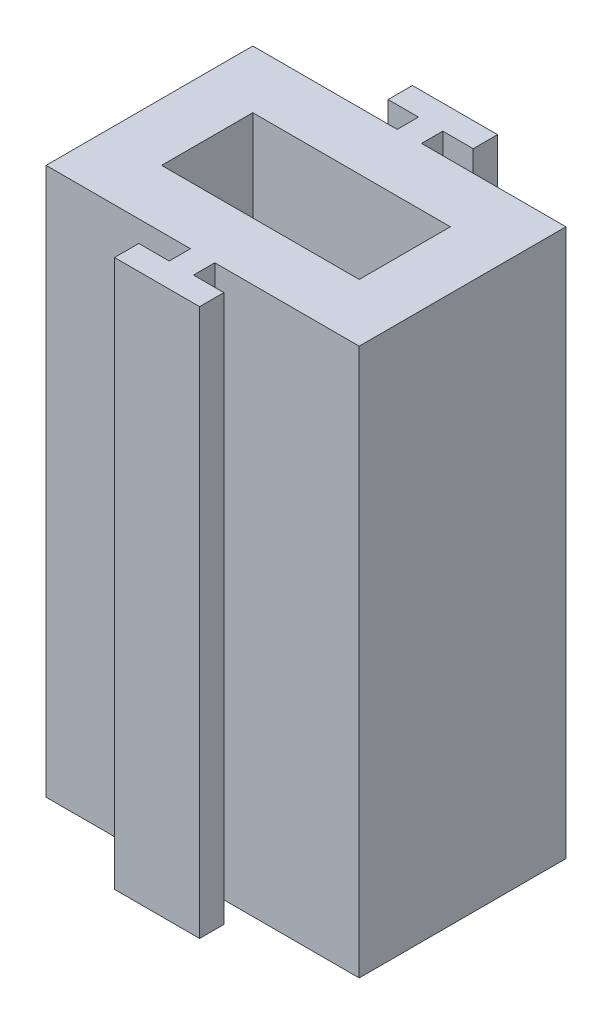
ISO-10303-21;
HEADER;
FILE_DESCRIPTION(('STEP AP214'),'2;1');
FILE_NAME('part.step','',(''),(''),'','','');
FILE_SCHEMA(('AUTOMOTIVE_DESIGN { 1 0 10303 214 1 1 1 1 }'));
ENDSEC;
DATA;
#1=APPLICATION_CONTEXT('core data for automotive mechanical design processes');
#2=APPLICATION_PROTOCOL_DEFINITION('international standard','automotive_design',2000,#1);
#3=PRODUCT_CONTEXT('',#1,'mechanical');
#4=PRODUCT('Part','Part','',(#3));
#5=PRODUCT_RELATED_PRODUCT_CATEGORY('part','',(#4));
#6=PRODUCT_DEFINITION_FORMATION('','',#4);
#7=PRODUCT_DEFINITION_CONTEXT('part definition',#1,'design');
#8=PRODUCT_DEFINITION('design','',#6,#7);
#9=PRODUCT_DEFINITION_SHAPE('','',#8);
#10=(LENGTH_UNIT() NAMED_UNIT(*) SI_UNIT(.MILLI.,.METRE.));
#11=(NAMED_UNIT(*) PLANE_ANGLE_UNIT() SI_UNIT($,.RADIAN.));
#12=(NAMED_UNIT(*) SI_UNIT($,.STERADIAN.) SOLID_ANGLE_UNIT());
#13=UNCERTAINTY_MEASURE_WITH_UNIT(LENGTH_MEASURE(1.E-05),#10,'distance_accuracy_value','');
#14=(GEOMETRIC_REPRESENTATION_CONTEXT(3) GLOBAL_UNCERTAINTY_ASSIGNED_CONTEXT((#13)) GLOBAL_UNIT_ASSIGNED_CONTEXT((#10,
#11,#12)) REPRESENTATION_CONTEXT('',''));
#15=CARTESIAN_POINT('',(0.,0.,0.));
#16=DIRECTION('',(0.,0.,1.));
#17=DIRECTION('',(1.,0.,0.));
#18=AXIS2_PLACEMENT_3D('',#15,#16,#17);
#19=CARTESIAN_POINT('',(0.,18.,-4.9));
#20=DIRECTION('',(0.,0.,-1.));
#21=DIRECTION('',(-1.,0.,0.));
#22=AXIS2_PLACEMENT_3D('',#19,#20,#21);
#23=PLANE('',#22);
#24=DIRECTION('',(1.,0.,0.));
#25=VECTOR('',#24,1.);
#26=CARTESIAN_POINT('',(0.,0.,-4.9));
#27=LINE('',#26,#25);
#28=CARTESIAN_POINT('',(-1.4,0.,-4.9));
#29=VERTEX_POINT('',#28);
#30=CARTESIAN_POINT('',(1.4,0.,-4.9));
#31=VERTEX_POINT('',#30);
#32=EDGE_CURVE('E226',#29,#31,#27,.T.);
#33=ORIENTED_EDGE('',*,*,#32,.F.);
#34=DIRECTION('',(0.,-1.,0.));
#35=VECTOR('',#34,1.);
#36=CARTESIAN_POINT('',(-1.4,18.,-4.9));
#37=LINE('',#36,#35);
#38=CARTESIAN_POINT('',(-1.4,18.,-4.9));
#39=VERTEX_POINT('',#38);
#40=EDGE_CURVE('E11',#39,#29,#37,.T.);
#41=ORIENTED_EDGE('',*,*,#40,.F.);
#42=DIRECTION('',(1.,0.,0.));
#43=VECTOR('',#42,1.);
#44=CARTESIAN_POINT('',(0.,18.,-4.9));
#45=LINE('',#44,#43);
#46=CARTESIAN_POINT('',(1.4,18.,-4.9));
#47=VERTEX_POINT('',#46);
#48=EDGE_CURVE('E230',#39,#47,#45,.T.);
#49=ORIENTED_EDGE('',*,*,#48,.T.);
#50=DIRECTION('',(0.,-1.,0.));
#51=VECTOR('',#50,1.);
#52=CARTESIAN_POINT('',(1.4,18.,-4.9));
#53=LINE('',#52,#51);
#54=EDGE_CURVE('E278',#47,#31,#53,.T.);
#55=ORIENTED_EDGE('',*,*,#54,.T.);
#56=EDGE_LOOP('',(#33,#41,#49,#55));
#57=FACE_BOUND('',#56,.T.);
#58=ADVANCED_FACE('F34',(#57),#23,.T.);
#59=CARTESIAN_POINT('',(-1.4,18.,0.));
#60=DIRECTION('',(1.,0.,0.));
#61=DIRECTION('',(0.,0.,-1.));
#62=AXIS2_PLACEMENT_3D('',#59,#60,#61);
#63=PLANE('',#62);
#64=DIRECTION('',(0.,0.,1.));
#65=VECTOR('',#64,1.);
#66=CARTESIAN_POINT('',(-1.4,0.,0.));
#67=LINE('',#66,#65);
#68=CARTESIAN_POINT('',(-1.4,0.,-4.1));
#69=VERTEX_POINT('',#68);
#70=EDGE_CURVE('E281',#29,#69,#67,.T.);
#71=ORIENTED_EDGE('',*,*,#70,.T.);
#72=DIRECTION('',(0.,-1.,0.));
#73=VECTOR('',#72,1.);
#74=CARTESIAN_POINT('',(-1.4,18.,-4.1));
#75=LINE('',#74,#73);
#76=CARTESIAN_POINT('',(-1.4,18.,-4.1));
#77=VERTEX_POINT('',#76);
#78=EDGE_CURVE('E41',#77,#69,#75,.T.);
#79=ORIENTED_EDGE('',*,*,#78,.F.);
#80=DIRECTION('',(0.,0.,1.));
#81=VECTOR('',#80,1.);
#82=CARTESIAN_POINT('',(-1.4,18.,0.));
#83=LINE('',#82,#81);
#84=EDGE_CURVE('E233',#39,#77,#83,.T.);
#85=ORIENTED_EDGE('',*,*,#84,.F.);
#86=ORIENTED_EDGE('',*,*,#40,.T.);
#87=EDGE_LOOP('',(#71,#79,#85,#86));
#88=FACE_BOUND('',#87,.T.);
#89=ADVANCED_FACE('F460',(#88),#63,.F.);
#90=CARTESIAN_POINT('',(0.,18.,-4.1));
#91=DIRECTION('',(0.,0.,-1.));
#92=DIRECTION('',(-1.,0.,0.));
#93=AXIS2_PLACEMENT_3D('',#90,#91,#92);
#94=PLANE('',#93);
#95=DIRECTION('',(1.,0.,0.));
#96=VECTOR('',#95,1.);
#97=CARTESIAN_POINT('',(0.,0.,-4.1));
#98=LINE('',#97,#96);
#99=CARTESIAN_POINT('',(-0.4,0.,-4.1));
#100=VERTEX_POINT('',#99);
#101=EDGE_CURVE('E283',#69,#100,#98,.T.);
#102=ORIENTED_EDGE('',*,*,#101,.T.);
#103=DIRECTION('',(0.,-1.,0.));
#104=VECTOR('',#103,1.);
#105=CARTESIAN_POINT('',(-0.4,18.,-4.1));
#106=LINE('',#105,#104);
#107=CARTESIAN_POINT('',(-0.4,18.,-4.1));
#108=VERTEX_POINT('',#107);
#109=EDGE_CURVE('E365',#108,#100,#106,.T.);
#110=ORIENTED_EDGE('',*,*,#109,.F.);
#111=DIRECTION('',(1.,0.,0.));
#112=VECTOR('',#111,1.);
#113=CARTESIAN_POINT('',(0.,18.,-4.1));
#114=LINE('',#113,#112);
#115=EDGE_CURVE('E236',#77,#108,#114,.T.);
#116=ORIENTED_EDGE('',*,*,#115,.F.);
#117=ORIENTED_EDGE('',*,*,#78,.T.);
#118=EDGE_LOOP('',(#102,#110,#116,#117));
#119=FACE_BOUND('',#118,.T.);
#120=ADVANCED_FACE('F371',(#119),#94,.F.);
#121=CARTESIAN_POINT('',(-0.399999999999999,18.,0.));
#122=DIRECTION('',(-1.,0.,0.));
#123=DIRECTION('',(0.,0.,1.));
#124=AXIS2_PLACEMENT_3D('',#121,#122,#123);
#125=PLANE('',#124);
#126=DIRECTION('',(0.,0.,-1.));
#127=VECTOR('',#126,1.);
#128=CARTESIAN_POINT('',(-0.399999999999999,0.,0.));
#129=LINE('',#128,#127);
#130=CARTESIAN_POINT('',(-0.4,0.,-3.4));
#131=VERTEX_POINT('',#130);
#132=EDGE_CURVE('E286',#131,#100,#129,.T.);
#133=ORIENTED_EDGE('',*,*,#132,.F.);
#134=DIRECTION('',(0.,-1.,0.));
#135=VECTOR('',#134,1.);
#136=CARTESIAN_POINT('',(-0.4,18.,-3.4));
#137=LINE('',#136,#135);
#138=CARTESIAN_POINT('',(-0.4,18.,-3.4));
#139=VERTEX_POINT('',#138);
#140=EDGE_CURVE('E363',#139,#131,#137,.T.);
#141=ORIENTED_EDGE('',*,*,#140,.F.);
#142=DIRECTION('',(0.,0.,-1.));
#143=VECTOR('',#142,1.);
#144=CARTESIAN_POINT('',(-0.399999999999999,18.,0.));
#145=LINE('',#144,#143);
#146=EDGE_CURVE('E238',#139,#108,#145,.T.);
#147=ORIENTED_EDGE('',*,*,#146,.T.);
#148=ORIENTED_EDGE('',*,*,#109,.T.);
#149=EDGE_LOOP('',(#133,#141,#147,#148));
#150=FACE_BOUND('',#149,.T.);
#151=ADVANCED_FACE('F381',(#150),#125,.T.);
#152=CARTESIAN_POINT('',(0.,18.,-3.4));
#153=DIRECTION('',(0.,0.,-1.));
#154=DIRECTION('',(-1.,0.,0.));
#155=AXIS2_PLACEMENT_3D('',#152,#153,#154);
#156=PLANE('',#155);
#157=DIRECTION('',(1.,0.,0.));
#158=VECTOR('',#157,1.);
#159=CARTESIAN_POINT('',(0.,0.,-3.4));
#160=LINE('',#159,#158);
#161=CARTESIAN_POINT('',(-5.15,0.,-3.4));
#162=VERTEX_POINT('',#161);
#163=EDGE_CURVE('E290',#162,#131,#160,.T.);
#164=ORIENTED_EDGE('',*,*,#163,.F.);
#165=DIRECTION('',(0.,-1.,0.));
#166=VECTOR('',#165,1.);
#167=CARTESIAN_POINT('',(-5.15,18.,-3.4));
#168=LINE('',#167,#166);
#169=CARTESIAN_POINT('',(-5.15,18.,-3.4));
#170=VERTEX_POINT('',#169);
#171=EDGE_CURVE('E361',#170,#162,#168,.T.);
#172=ORIENTED_EDGE('',*,*,#171,.F.);
#173=DIRECTION('',(1.,0.,0.));
#174=VECTOR('',#173,1.);
#175=CARTESIAN_POINT('',(0.,18.,-3.4));
#176=LINE('',#175,#174);
#177=EDGE_CURVE('E242',#170,#139,#176,.T.);
#178=ORIENTED_EDGE('',*,*,#177,.T.);
#179=ORIENTED_EDGE('',*,*,#140,.T.);
#180=EDGE_LOOP('',(#164,#172,#178,#179));
#181=FACE_BOUND('',#180,.T.);
#182=ADVANCED_FACE('F388',(#181),#156,.T.);
#183=CARTESIAN_POINT('',(-5.15,18.,0.));
#184=DIRECTION('',(1.,0.,0.));
#185=DIRECTION('',(0.,0.,-1.));
#186=AXIS2_PLACEMENT_3D('',#183,#184,#185);
#187=PLANE('',#186);
#188=DIRECTION('',(0.,0.,1.));
#189=VECTOR('',#188,1.);
#190=CARTESIAN_POINT('',(-5.15,0.,0.));
#191=LINE('',#190,#189);
#192=CARTESIAN_POINT('',(-5.15,0.,3.4));
#193=VERTEX_POINT('',#192);
#194=EDGE_CURVE('E293',#162,#193,#191,.T.);
#195=ORIENTED_EDGE('',*,*,#194,.T.);
#196=DIRECTION('',(0.,-1.,0.));
#197=VECTOR('',#196,1.);
#198=CARTESIAN_POINT('',(-5.15,18.,3.4));
#199=LINE('',#198,#197);
#200=CARTESIAN_POINT('',(-5.15,18.,3.4));
#201=VERTEX_POINT('',#200);
#202=EDGE_CURVE('E358',#201,#193,#199,.T.);
#203=ORIENTED_EDGE('',*,*,#202,.F.);
#204=DIRECTION('',(0.,0.,1.));
#205=VECTOR('',#204,1.);
#206=CARTESIAN_POINT('',(-5.15,18.,0.));
#207=LINE('',#206,#205);
#208=EDGE_CURVE('E245',#170,#201,#207,.T.);
#209=ORIENTED_EDGE('',*,*,#208,.F.);
#210=ORIENTED_EDGE('',*,*,#171,.T.);
#211=EDGE_LOOP('',(#195,#203,#209,#210));
#212=FACE_BOUND('',#211,.T.);
#213=ADVANCED_FACE('F392',(#212),#187,.F.);
#214=CARTESIAN_POINT('',(0.,18.,3.4));
#215=DIRECTION('',(0.,0.,-1.));
#216=DIRECTION('',(-1.,0.,0.));
#217=AXIS2_PLACEMENT_3D('',#214,#215,#216);
#218=PLANE('',#217);
#219=DIRECTION('',(1.,0.,0.));
#220=VECTOR('',#219,1.);
#221=CARTESIAN_POINT('',(0.,0.,3.4));
#222=LINE('',#221,#220);
#223=CARTESIAN_POINT('',(-0.4,0.,3.4));
#224=VERTEX_POINT('',#223);
#225=EDGE_CURVE('E295',#193,#224,#222,.T.);
#226=ORIENTED_EDGE('',*,*,#225,.T.);
#227=DIRECTION('',(0.,-1.,0.));
#228=VECTOR('',#227,1.);
#229=CARTESIAN_POINT('',(-0.4,18.,3.4));
#230=LINE('',#229,#228);
#231=CARTESIAN_POINT('',(-0.4,18.,3.4));
#232=VERTEX_POINT('',#231);
#233=EDGE_CURVE('E356',#232,#224,#230,.T.);
#234=ORIENTED_EDGE('',*,*,#233,.F.);
#235=DIRECTION('',(1.,0.,0.));
#236=VECTOR('',#235,1.);
#237=CARTESIAN_POINT('',(0.,18.,3.4));
#238=LINE('',#237,#236);
#239=EDGE_CURVE('E247',#201,#232,#238,.T.);
#240=ORIENTED_EDGE('',*,*,#239,.F.);
#241=ORIENTED_EDGE('',*,*,#202,.T.);
#242=EDGE_LOOP('',(#226,#234,#240,#241));
#243=FACE_BOUND('',#242,.T.);
#244=ADVANCED_FACE('F398',(#243),#218,.F.);
#245=CARTESIAN_POINT('',(-0.4,18.,0.));
#246=DIRECTION('',(-1.,0.,0.));
#247=DIRECTION('',(0.,0.,1.));
#248=AXIS2_PLACEMENT_3D('',#245,#246,#247);
#249=PLANE('',#248);
#250=DIRECTION('',(0.,0.,-1.));
#251=VECTOR('',#250,1.);
#252=CARTESIAN_POINT('',(-0.4,0.,0.));
#253=LINE('',#252,#251);
#254=CARTESIAN_POINT('',(-0.4,0.,4.1));
#255=VERTEX_POINT('',#254);
#256=EDGE_CURVE('E298',#255,#224,#253,.T.);
#257=ORIENTED_EDGE('',*,*,#256,.F.);
#258=DIRECTION('',(0.,-1.,0.));
#259=VECTOR('',#258,1.);
#260=CARTESIAN_POINT('',(-0.4,18.,4.1));
#261=LINE('',#260,#259);
#262=CARTESIAN_POINT('',(-0.4,18.,4.1));
#263=VERTEX_POINT('',#262);
#264=EDGE_CURVE('E354',#263,#255,#261,.T.);
#265=ORIENTED_EDGE('',*,*,#264,.F.);
#266=DIRECTION('',(0.,0.,-1.));
#267=VECTOR('',#266,1.);
#268=CARTESIAN_POINT('',(-0.4,18.,0.));
#269=LINE('',#268,#267);
#270=EDGE_CURVE('E249',#263,#232,#269,.T.);
#271=ORIENTED_EDGE('',*,*,#270,.T.);
#272=ORIENTED_EDGE('',*,*,#233,.T.);
#273=EDGE_LOOP('',(#257,#265,#271,#272));
#274=FACE_BOUND('',#273,.T.);
#275=ADVANCED_FACE('F402',(#274),#249,.T.);
#276=CARTESIAN_POINT('',(0.,18.,4.1));
#277=DIRECTION('',(0.,0.,-1.));
#278=DIRECTION('',(-1.,0.,0.));
#279=AXIS2_PLACEMENT_3D('',#276,#277,#278);
#280=PLANE('',#279);
#281=DIRECTION('',(1.,0.,0.));
#282=VECTOR('',#281,1.);
#283=CARTESIAN_POINT('',(0.,0.,4.1));
#284=LINE('',#283,#282);
#285=CARTESIAN_POINT('',(-1.4,0.,4.1));
#286=VERTEX_POINT('',#285);
#287=EDGE_CURVE('E301',#286,#255,#284,.T.);
#288=ORIENTED_EDGE('',*,*,#287,.F.);
#289=DIRECTION('',(0.,-1.,0.));
#290=VECTOR('',#289,1.);
#291=CARTESIAN_POINT('',(-1.4,18.,4.1));
#292=LINE('',#291,#290);
#293=CARTESIAN_POINT('',(-1.4,18.,4.1));
#294=VERTEX_POINT('',#293);
#295=EDGE_CURVE('E352',#294,#286,#292,.T.);
#296=ORIENTED_EDGE('',*,*,#295,.F.);
#297=DIRECTION('',(1.,0.,0.));
#298=VECTOR('',#297,1.);
#299=CARTESIAN_POINT('',(0.,18.,4.1));
#300=LINE('',#299,#298);
#301=EDGE_CURVE('E252',#294,#263,#300,.T.);
#302=ORIENTED_EDGE('',*,*,#301,.T.);
#303=ORIENTED_EDGE('',*,*,#264,.T.);
#304=EDGE_LOOP('',(#288,#296,#302,#303));
#305=FACE_BOUND('',#304,.T.);
#306=ADVANCED_FACE('F405',(#305),#280,.T.);
#307=CARTESIAN_POINT('',(-1.4,18.,0.));
#308=DIRECTION('',(1.,0.,0.));
#309=DIRECTION('',(0.,0.,-1.));
#310=AXIS2_PLACEMENT_3D('',#307,#308,#309);
#311=PLANE('',#310);
#312=DIRECTION('',(0.,0.,1.));
#313=VECTOR('',#312,1.);
#314=CARTESIAN_POINT('',(-1.4,0.,0.));
#315=LINE('',#314,#313);
#316=CARTESIAN_POINT('',(-1.4,0.,4.9));
#317=VERTEX_POINT('',#316);
#318=EDGE_CURVE('E304',#286,#317,#315,.T.);
#319=ORIENTED_EDGE('',*,*,#318,.T.);
#320=DIRECTION('',(0.,-1.,0.));
#321=VECTOR('',#320,1.);
#322=CARTESIAN_POINT('',(-1.4,18.,4.9));
#323=LINE('',#322,#321);
#324=CARTESIAN_POINT('',(-1.4,18.,4.9));
#325=VERTEX_POINT('',#324);
#326=EDGE_CURVE('E349',#325,#317,#323,.T.);
#327=ORIENTED_EDGE('',*,*,#326,.F.);
#328=DIRECTION('',(0.,0.,1.));
#329=VECTOR('',#328,1.);
#330=CARTESIAN_POINT('',(-1.4,18.,0.));
#331=LINE('',#330,#329);
#332=EDGE_CURVE('E255',#294,#325,#331,.T.);
#333=ORIENTED_EDGE('',*,*,#332,.F.);
#334=ORIENTED_EDGE('',*,*,#295,.T.);
#335=EDGE_LOOP('',(#319,#327,#333,#334));
#336=FACE_BOUND('',#335,.T.);
#337=ADVANCED_FACE('F412',(#336),#311,.F.);
#338=CARTESIAN_POINT('',(0.,18.,4.9));
#339=DIRECTION('',(0.,0.,-1.));
#340=DIRECTION('',(-1.,0.,0.));
#341=AXIS2_PLACEMENT_3D('',#338,#339,#340);
#342=PLANE('',#341);
#343=DIRECTION('',(1.,0.,0.));
#344=VECTOR('',#343,1.);
#345=CARTESIAN_POINT('',(0.,0.,4.9));
#346=LINE('',#345,#344);
#347=CARTESIAN_POINT('',(1.4,0.,4.9));
#348=VERTEX_POINT('',#347);
#349=EDGE_CURVE('E307',#317,#348,#346,.T.);
#350=ORIENTED_EDGE('',*,*,#349,.T.);
#351=DIRECTION('',(0.,-1.,0.));
#352=VECTOR('',#351,1.);
#353=CARTESIAN_POINT('',(1.4,18.,4.9));
#354=LINE('',#353,#352);
#355=CARTESIAN_POINT('',(1.4,18.,4.9));
#356=VERTEX_POINT('',#355);
#357=EDGE_CURVE('E347',#356,#348,#354,.T.);
#358=ORIENTED_EDGE('',*,*,#357,.F.);
#359=DIRECTION('',(1.,0.,0.));
#360=VECTOR('',#359,1.);
#361=CARTESIAN_POINT('',(0.,18.,4.9));
#362=LINE('',#361,#360);
#363=EDGE_CURVE('E258',#325,#356,#362,.T.);
#364=ORIENTED_EDGE('',*,*,#363,.F.);
#365=ORIENTED_EDGE('',*,*,#326,.T.);
#366=EDGE_LOOP('',(#350,#358,#364,#365));
#367=FACE_BOUND('',#366,.T.);
#368=ADVANCED_FACE('F416',(#367),#342,.F.);
#369=CARTESIAN_POINT('',(1.4,18.,0.));
#370=DIRECTION('',(1.,0.,0.));
#371=DIRECTION('',(0.,0.,-1.));
#372=AXIS2_PLACEMENT_3D('',#369,#370,#371);
#373=PLANE('',#372);
#374=DIRECTION('',(0.,0.,1.));
#375=VECTOR('',#374,1.);
#376=CARTESIAN_POINT('',(1.4,0.,0.));
#377=LINE('',#376,#375);
#378=CARTESIAN_POINT('',(1.4,0.,4.1));
#379=VERTEX_POINT('',#378);
#380=EDGE_CURVE('E310',#379,#348,#377,.T.);
#381=ORIENTED_EDGE('',*,*,#380,.F.);
#382=DIRECTION('',(0.,-1.,0.));
#383=VECTOR('',#382,1.);
#384=CARTESIAN_POINT('',(1.4,18.,4.1));
#385=LINE('',#384,#383);
#386=CARTESIAN_POINT('',(1.4,18.,4.1));
#387=VERTEX_POINT('',#386);
#388=EDGE_CURVE('E345',#387,#379,#385,.T.);
#389=ORIENTED_EDGE('',*,*,#388,.F.);
#390=DIRECTION('',(0.,0.,1.));
#391=VECTOR('',#390,1.);
#392=CARTESIAN_POINT('',(1.4,18.,0.));
#393=LINE('',#392,#391);
#394=EDGE_CURVE('E260',#387,#356,#393,.T.);
#395=ORIENTED_EDGE('',*,*,#394,.T.);
#396=ORIENTED_EDGE('',*,*,#357,.T.);
#397=EDGE_LOOP('',(#381,#389,#395,#396));
#398=FACE_BOUND('',#397,.T.);
#399=ADVANCED_FACE('F419',(#398),#373,.T.);
#400=CARTESIAN_POINT('',(0.4,0.,4.1));
#401=VERTEX_POINT('',#400);
#402=EDGE_CURVE('E305',#401,#379,#284,.T.);
#403=ORIENTED_EDGE('',*,*,#402,.F.);
#404=DIRECTION('',(0.,-1.,0.));
#405=VECTOR('',#404,1.);
#406=CARTESIAN_POINT('',(0.4,18.,4.1));
#407=LINE('',#406,#405);
#408=CARTESIAN_POINT('',(0.4,18.,4.1));
#409=VERTEX_POINT('',#408);
#410=EDGE_CURVE('E343',#409,#401,#407,.T.);
#411=ORIENTED_EDGE('',*,*,#410,.F.);
#412=EDGE_CURVE('E256',#409,#387,#300,.T.);
#413=ORIENTED_EDGE('',*,*,#412,.T.);
#414=ORIENTED_EDGE('',*,*,#388,.T.);
#415=EDGE_LOOP('',(#403,#411,#413,#414));
#416=FACE_BOUND('',#415,.T.);
#417=ADVANCED_FACE('F424',(#416),#280,.T.);
#418=CARTESIAN_POINT('',(0.4,18.,0.));
#419=DIRECTION('',(-1.,0.,0.));
#420=DIRECTION('',(0.,0.,1.));
#421=AXIS2_PLACEMENT_3D('',#418,#419,#420);
#422=PLANE('',#421);
#423=DIRECTION('',(0.,0.,-1.));
#424=VECTOR('',#423,1.);
#425=CARTESIAN_POINT('',(0.4,0.,0.));
#426=LINE('',#425,#424);
#427=CARTESIAN_POINT('',(0.4,0.,3.4));
#428=VERTEX_POINT('',#427);
#429=EDGE_CURVE('E313',#401,#428,#426,.T.);
#430=ORIENTED_EDGE('',*,*,#429,.T.);
#431=DIRECTION('',(0.,-1.,0.));
#432=VECTOR('',#431,1.);
#433=CARTESIAN_POINT('',(0.4,18.,3.4));
#434=LINE('',#433,#432);
#435=CARTESIAN_POINT('',(0.4,18.,3.4));
#436=VERTEX_POINT('',#435);
#437=EDGE_CURVE('E340',#436,#428,#434,.T.);
#438=ORIENTED_EDGE('',*,*,#437,.F.);
#439=DIRECTION('',(0.,0.,-1.));
#440=VECTOR('',#439,1.);
#441=CARTESIAN_POINT('',(0.4,18.,0.));
#442=LINE('',#441,#440);
#443=EDGE_CURVE('E263',#409,#436,#442,.T.);
#444=ORIENTED_EDGE('',*,*,#443,.F.);
#445=ORIENTED_EDGE('',*,*,#410,.T.);
#446=EDGE_LOOP('',(#430,#438,#444,#445));
#447=FACE_BOUND('',#446,.T.);
#448=ADVANCED_FACE('F430',(#447),#422,.F.);
#449=CARTESIAN_POINT('',(0.,18.,3.4));
#450=DIRECTION('',(0.,0.,-1.));
#451=DIRECTION('',(-1.,0.,0.));
#452=AXIS2_PLACEMENT_3D('',#449,#450,#451);
#453=PLANE('',#452);
#454=DIRECTION('',(1.,0.,0.));
#455=VECTOR('',#454,1.);
#456=CARTESIAN_POINT('',(0.,0.,3.4));
#457=LINE('',#456,#455);
#458=CARTESIAN_POINT('',(5.15,0.,3.4));
#459=VERTEX_POINT('',#458);
#460=EDGE_CURVE('E315',#428,#459,#457,.T.);
#461=ORIENTED_EDGE('',*,*,#460,.T.);
#462=DIRECTION('',(0.,-1.,0.));
#463=VECTOR('',#462,1.);
#464=CARTESIAN_POINT('',(5.15,18.,3.4));
#465=LINE('',#464,#463);
#466=CARTESIAN_POINT('',(5.15,18.,3.4));
#467=VERTEX_POINT('',#466);
#468=EDGE_CURVE('E338',#467,#459,#465,.T.);
#469=ORIENTED_EDGE('',*,*,#468,.F.);
#470=DIRECTION('',(1.,0.,0.));
#471=VECTOR('',#470,1.);
#472=CARTESIAN_POINT('',(0.,18.,3.4));
#473=LINE('',#472,#471);
#474=EDGE_CURVE('E265',#436,#467,#473,.T.);
#475=ORIENTED_EDGE('',*,*,#474,.F.);
#476=ORIENTED_EDGE('',*,*,#437,.T.);
#477=EDGE_LOOP('',(#461,#469,#475,#476));
#478=FACE_BOUND('',#477,.T.);
#479=ADVANCED_FACE('F436',(#478),#453,.F.);
#480=CARTESIAN_POINT('',(5.15,18.,0.));
#481=DIRECTION('',(1.,0.,0.));
#482=DIRECTION('',(0.,0.,-1.));
#483=AXIS2_PLACEMENT_3D('',#480,#481,#482);
#484=PLANE('',#483);
#485=DIRECTION('',(0.,0.,1.));
#486=VECTOR('',#485,1.);
#487=CARTESIAN_POINT('',(5.15,0.,0.));
#488=LINE('',#487,#486);
#489=CARTESIAN_POINT('',(5.15,0.,-3.4));
#490=VERTEX_POINT('',#489);
#491=EDGE_CURVE('E318',#490,#459,#488,.T.);
#492=ORIENTED_EDGE('',*,*,#491,.F.);
#493=DIRECTION('',(0.,-1.,0.));
#494=VECTOR('',#493,1.);
#495=CARTESIAN_POINT('',(5.15,18.,-3.4));
#496=LINE('',#495,#494);
#497=CARTESIAN_POINT('',(5.15,18.,-3.4));
#498=VERTEX_POINT('',#497);
#499=EDGE_CURVE('E336',#498,#490,#496,.T.);
#500=ORIENTED_EDGE('',*,*,#499,.F.);
#501=DIRECTION('',(0.,0.,1.));
#502=VECTOR('',#501,1.);
#503=CARTESIAN_POINT('',(5.15,18.,0.));
#504=LINE('',#503,#502);
#505=EDGE_CURVE('E267',#498,#467,#504,.T.);
#506=ORIENTED_EDGE('',*,*,#505,.T.);
#507=ORIENTED_EDGE('',*,*,#468,.T.);
#508=EDGE_LOOP('',(#492,#500,#506,#507));
#509=FACE_BOUND('',#508,.T.);
#510=ADVANCED_FACE('F440',(#509),#484,.T.);
#511=CARTESIAN_POINT('',(0.,18.,-3.4));
#512=DIRECTION('',(0.,0.,-1.));
#513=DIRECTION('',(-1.,0.,0.));
#514=AXIS2_PLACEMENT_3D('',#511,#512,#513);
#515=PLANE('',#514);
#516=DIRECTION('',(1.,0.,0.));
#517=VECTOR('',#516,1.);
#518=CARTESIAN_POINT('',(0.,0.,-3.4));
#519=LINE('',#518,#517);
#520=CARTESIAN_POINT('',(0.4,0.,-3.4));
#521=VERTEX_POINT('',#520);
#522=EDGE_CURVE('E321',#521,#490,#519,.T.);
#523=ORIENTED_EDGE('',*,*,#522,.F.);
#524=DIRECTION('',(0.,-1.,0.));
#525=VECTOR('',#524,1.);
#526=CARTESIAN_POINT('',(0.4,18.,-3.4));
#527=LINE('',#526,#525);
#528=CARTESIAN_POINT('',(0.4,18.,-3.4));
#529=VERTEX_POINT('',#528);
#530=EDGE_CURVE('E334',#529,#521,#527,.T.);
#531=ORIENTED_EDGE('',*,*,#530,.F.);
#532=DIRECTION('',(1.,0.,0.));
#533=VECTOR('',#532,1.);
#534=CARTESIAN_POINT('',(0.,18.,-3.4));
#535=LINE('',#534,#533);
#536=EDGE_CURVE('E270',#529,#498,#535,.T.);
#537=ORIENTED_EDGE('',*,*,#536,.T.);
#538=ORIENTED_EDGE('',*,*,#499,.T.);
#539=EDGE_LOOP('',(#523,#531,#537,#538));
#540=FACE_BOUND('',#539,.T.);
#541=ADVANCED_FACE('F443',(#540),#515,.T.);
#542=CARTESIAN_POINT('',(0.399999999999999,18.,0.));
#543=DIRECTION('',(-1.,0.,0.));
#544=DIRECTION('',(0.,0.,1.));
#545=AXIS2_PLACEMENT_3D('',#542,#543,#544);
#546=PLANE('',#545);
#547=DIRECTION('',(0.,0.,-1.));
#548=VECTOR('',#547,1.);
#549=CARTESIAN_POINT('',(0.399999999999999,0.,0.));
#550=LINE('',#549,#548);
#551=CARTESIAN_POINT('',(0.4,0.,-4.1));
#552=VERTEX_POINT('',#551);
#553=EDGE_CURVE('E324',#521,#552,#550,.T.);
#554=ORIENTED_EDGE('',*,*,#553,.T.);
#555=DIRECTION('',(0.,-1.,0.));
#556=VECTOR('',#555,1.);
#557=CARTESIAN_POINT('',(0.4,18.,-4.1));
#558=LINE('',#557,#556);
#559=CARTESIAN_POINT('',(0.4,18.,-4.1));
#560=VERTEX_POINT('',#559);
#561=EDGE_CURVE('E331',#560,#552,#558,.T.);
#562=ORIENTED_EDGE('',*,*,#561,.F.);
#563=DIRECTION('',(0.,0.,-1.));
#564=VECTOR('',#563,1.);
#565=CARTESIAN_POINT('',(0.399999999999999,18.,0.));
#566=LINE('',#565,#564);
#567=EDGE_CURVE('E273',#529,#560,#566,.T.);
#568=ORIENTED_EDGE('',*,*,#567,.F.);
#569=ORIENTED_EDGE('',*,*,#530,.T.);
#570=EDGE_LOOP('',(#554,#562,#568,#569));
#571=FACE_BOUND('',#570,.T.);
#572=ADVANCED_FACE('F450',(#571),#546,.F.);
#573=CARTESIAN_POINT('',(1.4,0.,-4.1));
#574=VERTEX_POINT('',#573);
#575=EDGE_CURVE('E287',#552,#574,#98,.T.);
#576=ORIENTED_EDGE('',*,*,#575,.T.);
#577=DIRECTION('',(0.,-1.,0.));
#578=VECTOR('',#577,1.);
#579=CARTESIAN_POINT('',(1.4,18.,-4.1));
#580=LINE('',#579,#578);
#581=CARTESIAN_POINT('',(1.4,18.,-4.1));
#582=VERTEX_POINT('',#581);
#583=EDGE_CURVE('E329',#582,#574,#580,.T.);
#584=ORIENTED_EDGE('',*,*,#583,.F.);
#585=EDGE_CURVE('E239',#560,#582,#114,.T.);
#586=ORIENTED_EDGE('',*,*,#585,.F.);
#587=ORIENTED_EDGE('',*,*,#561,.T.);
#588=EDGE_LOOP('',(#576,#584,#586,#587));
#589=FACE_BOUND('',#588,.T.);
#590=ADVANCED_FACE('F455',(#589),#94,.F.);
#591=CARTESIAN_POINT('',(1.4,18.,0.));
#592=DIRECTION('',(1.,0.,0.));
#593=DIRECTION('',(0.,0.,-1.));
#594=AXIS2_PLACEMENT_3D('',#591,#592,#593);
#595=PLANE('',#594);
#596=DIRECTION('',(0.,0.,1.));
#597=VECTOR('',#596,1.);
#598=CARTESIAN_POINT('',(1.4,0.,0.));
#599=LINE('',#598,#597);
#600=EDGE_CURVE('E234',#31,#574,#599,.T.);
#601=ORIENTED_EDGE('',*,*,#600,.F.);
#602=ORIENTED_EDGE('',*,*,#54,.F.);
#603=DIRECTION('',(0.,0.,1.));
#604=VECTOR('',#603,1.);
#605=CARTESIAN_POINT('',(1.4,18.,0.));
#606=LINE('',#605,#604);
#607=EDGE_CURVE('E275',#47,#582,#606,.T.);
#608=ORIENTED_EDGE('',*,*,#607,.T.);
#609=ORIENTED_EDGE('',*,*,#583,.T.);
#610=EDGE_LOOP('',(#601,#602,#608,#609));
#611=FACE_BOUND('',#610,.T.);
#612=ADVANCED_FACE('F458',(#611),#595,.T.);
#613=CARTESIAN_POINT('',(0.,18.,0.));
#614=DIRECTION('',(0.,1.,0.));
#615=DIRECTION('',(0.,0.,1.));
#616=AXIS2_PLACEMENT_3D('',#613,#614,#615);
#617=PLANE('',#616);
#618=DIRECTION('',(0.,0.,-1.));
#619=VECTOR('',#618,1.);
#620=CARTESIAN_POINT('',(3.25,18.,1.5));
#621=LINE('',#620,#619);
#622=CARTESIAN_POINT('',(3.25,18.,1.5));
#623=VERTEX_POINT('',#622);
#624=CARTESIAN_POINT('',(3.25,18.,-1.5));
#625=VERTEX_POINT('',#624);
#626=EDGE_CURVE('E48',#623,#625,#621,.T.);
#627=ORIENTED_EDGE('',*,*,#626,.F.);
#628=DIRECTION('',(1.,0.,0.));
#629=VECTOR('',#628,1.);
#630=CARTESIAN_POINT('',(-3.25,18.,1.5));
#631=LINE('',#630,#629);
#632=CARTESIAN_POINT('',(-3.25,18.,1.5));
#633=VERTEX_POINT('',#632);
#634=EDGE_CURVE('E211',#633,#623,#631,.T.);
#635=ORIENTED_EDGE('',*,*,#634,.F.);
#636=DIRECTION('',(0.,0.,1.));
#637=VECTOR('',#636,1.);
#638=CARTESIAN_POINT('',(-3.25,18.,1.5));
#639=LINE('',#638,#637);
#640=CARTESIAN_POINT('',(-3.25,18.,-1.5));
#641=VERTEX_POINT('',#640);
#642=EDGE_CURVE('E214',#641,#633,#639,.T.);
#643=ORIENTED_EDGE('',*,*,#642,.F.);
#644=DIRECTION('',(-1.,0.,0.));
#645=VECTOR('',#644,1.);
#646=CARTESIAN_POINT('',(-3.25,18.,-1.5));
#647=LINE('',#646,#645);
#648=EDGE_CURVE('E220',#625,#641,#647,.T.);
#649=ORIENTED_EDGE('',*,*,#648,.F.);
#650=EDGE_LOOP('',(#627,#635,#643,#649));
#651=FACE_BOUND('',#650,.T.);
#652=ORIENTED_EDGE('',*,*,#48,.F.);
#653=ORIENTED_EDGE('',*,*,#84,.T.);
#654=ORIENTED_EDGE('',*,*,#115,.T.);
#655=ORIENTED_EDGE('',*,*,#146,.F.);
#656=ORIENTED_EDGE('',*,*,#177,.F.);
#657=ORIENTED_EDGE('',*,*,#208,.T.);
#658=ORIENTED_EDGE('',*,*,#239,.T.);
#659=ORIENTED_EDGE('',*,*,#270,.F.);
#660=ORIENTED_EDGE('',*,*,#301,.F.);
#661=ORIENTED_EDGE('',*,*,#332,.T.);
#662=ORIENTED_EDGE('',*,*,#363,.T.);
#663=ORIENTED_EDGE('',*,*,#394,.F.);
#664=ORIENTED_EDGE('',*,*,#412,.F.);
#665=ORIENTED_EDGE('',*,*,#443,.T.);
#666=ORIENTED_EDGE('',*,*,#474,.T.);
#667=ORIENTED_EDGE('',*,*,#505,.F.);
#668=ORIENTED_EDGE('',*,*,#536,.F.);
#669=ORIENTED_EDGE('',*,*,#567,.T.);
#670=ORIENTED_EDGE('',*,*,#585,.T.);
#671=ORIENTED_EDGE('',*,*,#607,.F.);
#672=EDGE_LOOP('',(#652,#653,#654,#655,#656,#657,#658,#659,#660,#661,#662,#663,#664,#665,#666,
#667,#668,#669,#670,#671));
#673=FACE_BOUND('',#672,.T.);
#674=ADVANCED_FACE('F386',(#651,#673),#617,.T.);
#675=CARTESIAN_POINT('',(0.,0.,0.));
#676=DIRECTION('',(0.,1.,0.));
#677=DIRECTION('',(0.,0.,1.));
#678=AXIS2_PLACEMENT_3D('',#675,#676,#677);
#679=PLANE('',#678);
#680=DIRECTION('',(1.,0.,0.));
#681=VECTOR('',#680,1.);
#682=CARTESIAN_POINT('',(-3.25,0.,1.5));
#683=LINE('',#682,#681);
#684=CARTESIAN_POINT('',(-3.25,0.,1.5));
#685=VERTEX_POINT('',#684);
#686=CARTESIAN_POINT('',(3.25,0.,1.5));
#687=VERTEX_POINT('',#686);
#688=EDGE_CURVE('E201',#685,#687,#683,.T.);
#689=ORIENTED_EDGE('',*,*,#688,.T.);
#690=DIRECTION('',(0.,0.,-1.));
#691=VECTOR('',#690,1.);
#692=CARTESIAN_POINT('',(3.25,0.,1.5));
#693=LINE('',#692,#691);
#694=CARTESIAN_POINT('',(3.25,0.,-1.5));
#695=VERTEX_POINT('',#694);
#696=EDGE_CURVE('E195',#687,#695,#693,.T.);
#697=ORIENTED_EDGE('',*,*,#696,.T.);
#698=DIRECTION('',(-1.,0.,0.));
#699=VECTOR('',#698,1.);
#700=CARTESIAN_POINT('',(-3.25,0.,-1.5));
#701=LINE('',#700,#699);
#702=CARTESIAN_POINT('',(-3.25,0.,-1.5));
#703=VERTEX_POINT('',#702);
#704=EDGE_CURVE('E204',#695,#703,#701,.T.);
#705=ORIENTED_EDGE('',*,*,#704,.T.);
#706=DIRECTION('',(0.,0.,1.));
#707=VECTOR('',#706,1.);
#708=CARTESIAN_POINT('',(-3.25,0.,1.5));
#709=LINE('',#708,#707);
#710=EDGE_CURVE('E56',#703,#685,#709,.T.);
#711=ORIENTED_EDGE('',*,*,#710,.T.);
#712=EDGE_LOOP('',(#689,#697,#705,#711));
#713=FACE_BOUND('',#712,.T.);
#714=ORIENTED_EDGE('',*,*,#32,.T.);
#715=ORIENTED_EDGE('',*,*,#600,.T.);
#716=ORIENTED_EDGE('',*,*,#575,.F.);
#717=ORIENTED_EDGE('',*,*,#553,.F.);
#718=ORIENTED_EDGE('',*,*,#522,.T.);
#719=ORIENTED_EDGE('',*,*,#491,.T.);
#720=ORIENTED_EDGE('',*,*,#460,.F.);
#721=ORIENTED_EDGE('',*,*,#429,.F.);
#722=ORIENTED_EDGE('',*,*,#402,.T.);
#723=ORIENTED_EDGE('',*,*,#380,.T.);
#724=ORIENTED_EDGE('',*,*,#349,.F.);
#725=ORIENTED_EDGE('',*,*,#318,.F.);
#726=ORIENTED_EDGE('',*,*,#287,.T.);
#727=ORIENTED_EDGE('',*,*,#256,.T.);
#728=ORIENTED_EDGE('',*,*,#225,.F.);
#729=ORIENTED_EDGE('',*,*,#194,.F.);
#730=ORIENTED_EDGE('',*,*,#163,.T.);
#731=ORIENTED_EDGE('',*,*,#132,.T.);
#732=ORIENTED_EDGE('',*,*,#101,.F.);
#733=ORIENTED_EDGE('',*,*,#70,.F.);
#734=EDGE_LOOP('',(#714,#715,#716,#717,#718,#719,#720,#721,#722,#723,#724,#725,#726,#727,#728,
#729,#730,#731,#732,#733));
#735=FACE_BOUND('',#734,.T.);
#736=ADVANCED_FACE('F208',(#713,#735),#679,.F.);
#737=CARTESIAN_POINT('',(3.25,0.,1.5));
#738=DIRECTION('',(1.,0.,0.));
#739=DIRECTION('',(0.,0.,-1.));
#740=AXIS2_PLACEMENT_3D('',#737,#738,#739);
#741=PLANE('',#740);
#742=ORIENTED_EDGE('',*,*,#626,.T.);
#743=DIRECTION('',(0.,1.,0.));
#744=VECTOR('',#743,1.);
#745=CARTESIAN_POINT('',(3.25,0.,-1.5));
#746=LINE('',#745,#744);
#747=EDGE_CURVE('E191',#695,#625,#746,.T.);
#748=ORIENTED_EDGE('',*,*,#747,.F.);
#749=ORIENTED_EDGE('',*,*,#696,.F.);
#750=DIRECTION('',(0.,1.,0.));
#751=VECTOR('',#750,1.);
#752=CARTESIAN_POINT('',(3.25,0.,1.5));
#753=LINE('',#752,#751);
#754=EDGE_CURVE('E224',#687,#623,#753,.T.);
#755=ORIENTED_EDGE('',*,*,#754,.T.);
#756=EDGE_LOOP('',(#742,#748,#749,#755));
#757=FACE_BOUND('',#756,.T.);
#758=ADVANCED_FACE('F193',(#757),#741,.F.);
#759=CARTESIAN_POINT('',(-3.25,0.,1.5));
#760=DIRECTION('',(0.,0.,1.));
#761=DIRECTION('',(1.,0.,0.));
#762=AXIS2_PLACEMENT_3D('',#759,#760,#761);
#763=PLANE('',#762);
#764=ORIENTED_EDGE('',*,*,#634,.T.);
#765=ORIENTED_EDGE('',*,*,#754,.F.);
#766=ORIENTED_EDGE('',*,*,#688,.F.);
#767=DIRECTION('',(0.,1.,0.));
#768=VECTOR('',#767,1.);
#769=CARTESIAN_POINT('',(-3.25,0.,1.5));
#770=LINE('',#769,#768);
#771=EDGE_CURVE('E227',#685,#633,#770,.T.);
#772=ORIENTED_EDGE('',*,*,#771,.T.);
#773=EDGE_LOOP('',(#764,#765,#766,#772));
#774=FACE_BOUND('',#773,.T.);
#775=ADVANCED_FACE('F506',(#774),#763,.F.);
#776=CARTESIAN_POINT('',(-3.25,0.,1.5));
#777=DIRECTION('',(-1.,0.,0.));
#778=DIRECTION('',(0.,0.,1.));
#779=AXIS2_PLACEMENT_3D('',#776,#777,#778);
#780=PLANE('',#779);
#781=ORIENTED_EDGE('',*,*,#642,.T.);
#782=ORIENTED_EDGE('',*,*,#771,.F.);
#783=ORIENTED_EDGE('',*,*,#710,.F.);
#784=DIRECTION('',(0.,1.,0.));
#785=VECTOR('',#784,1.);
#786=CARTESIAN_POINT('',(-3.25,0.,-1.5));
#787=LINE('',#786,#785);
#788=EDGE_CURVE('E200',#703,#641,#787,.T.);
#789=ORIENTED_EDGE('',*,*,#788,.T.);
#790=EDGE_LOOP('',(#781,#782,#783,#789));
#791=FACE_BOUND('',#790,.T.);
#792=ADVANCED_FACE('F509',(#791),#780,.F.);
#793=CARTESIAN_POINT('',(-3.25,0.,-1.5));
#794=DIRECTION('',(0.,0.,-1.));
#795=DIRECTION('',(-1.,0.,0.));
#796=AXIS2_PLACEMENT_3D('',#793,#794,#795);
#797=PLANE('',#796);
#798=ORIENTED_EDGE('',*,*,#648,.T.);
#799=ORIENTED_EDGE('',*,*,#788,.F.);
#800=ORIENTED_EDGE('',*,*,#704,.F.);
#801=ORIENTED_EDGE('',*,*,#747,.T.);
#802=EDGE_LOOP('',(#798,#799,#800,#801));
#803=FACE_BOUND('',#802,.T.);
#804=ADVANCED_FACE('F205',(#803),#797,.F.);
#805=CLOSED_SHELL('',(#58,#89,#120,#151,#182,#213,#244,#275,#306,#337,#368,#399,#417,#448,#479,
#510,#541,#572,#590,#612,#674,#736,#758,#775,#792,#804));
#806=MANIFOLD_SOLID_BREP('B2',#805);
#807=ADVANCED_BREP_SHAPE_REPRESENTATION('',(#18,#806),#14);
#808=SHAPE_DEFINITION_REPRESENTATION(#9,#807);
ENDSEC;
END-ISO-10303-21;
